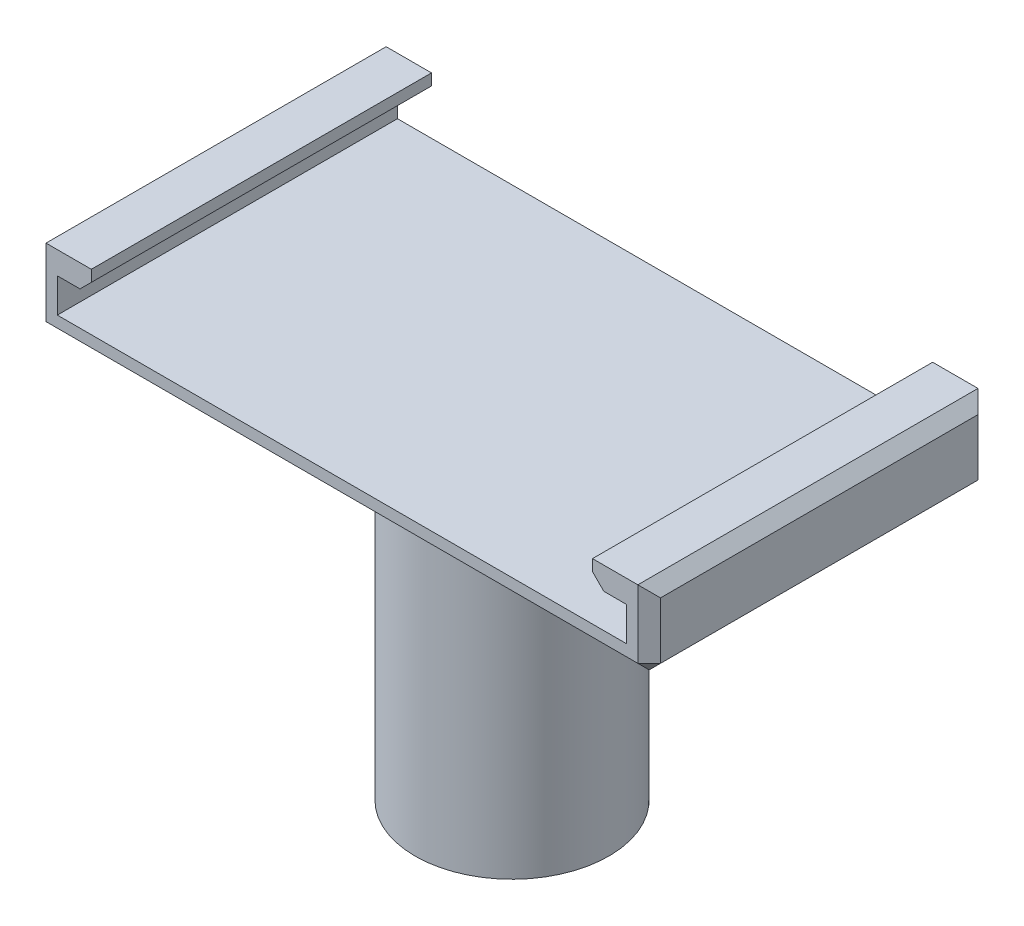
ISO-10303-21;
HEADER;
FILE_DESCRIPTION(('STEP AP214'),'2;1');
FILE_NAME('part.step','',(''),(''),'','','');
FILE_SCHEMA(('AUTOMOTIVE_DESIGN { 1 0 10303 214 1 1 1 1 }'));
ENDSEC;
DATA;
#1=APPLICATION_CONTEXT('core data for automotive mechanical design processes');
#2=APPLICATION_PROTOCOL_DEFINITION('international standard','automotive_design',2000,#1);
#3=PRODUCT_CONTEXT('',#1,'mechanical');
#4=PRODUCT('Part','Part','',(#3));
#5=PRODUCT_RELATED_PRODUCT_CATEGORY('part','',(#4));
#6=PRODUCT_DEFINITION_FORMATION('','',#4);
#7=PRODUCT_DEFINITION_CONTEXT('part definition',#1,'design');
#8=PRODUCT_DEFINITION('design','',#6,#7);
#9=PRODUCT_DEFINITION_SHAPE('','',#8);
#10=(LENGTH_UNIT() NAMED_UNIT(*) SI_UNIT(.MILLI.,.METRE.));
#11=(NAMED_UNIT(*) PLANE_ANGLE_UNIT() SI_UNIT($,.RADIAN.));
#12=(NAMED_UNIT(*) SI_UNIT($,.STERADIAN.) SOLID_ANGLE_UNIT());
#13=UNCERTAINTY_MEASURE_WITH_UNIT(LENGTH_MEASURE(1.E-05),#10,'distance_accuracy_value','');
#14=(GEOMETRIC_REPRESENTATION_CONTEXT(3) GLOBAL_UNCERTAINTY_ASSIGNED_CONTEXT((#13)) GLOBAL_UNIT_ASSIGNED_CONTEXT((#10,
#11,#12)) REPRESENTATION_CONTEXT('',''));
#15=CARTESIAN_POINT('',(0.,0.,0.));
#16=DIRECTION('',(0.,0.,1.));
#17=DIRECTION('',(1.,0.,0.));
#18=AXIS2_PLACEMENT_3D('',#15,#16,#17);
#19=CARTESIAN_POINT('',(25.1,37.,-15.));
#20=DIRECTION('',(1.,0.,0.));
#21=DIRECTION('',(0.,0.,-1.));
#22=AXIS2_PLACEMENT_3D('',#19,#20,#21);
#23=PLANE('',#22);
#24=DIRECTION('',(0.,0.,1.));
#25=VECTOR('',#24,1.);
#26=CARTESIAN_POINT('',(25.1,35.,-15.));
#27=LINE('',#26,#25);
#28=CARTESIAN_POINT('',(25.1,35.,-15.));
#29=VERTEX_POINT('',#28);
#30=CARTESIAN_POINT('',(25.1,35.,15.));
#31=VERTEX_POINT('',#30);
#32=EDGE_CURVE('E212',#29,#31,#27,.T.);
#33=ORIENTED_EDGE('',*,*,#32,.F.);
#34=DIRECTION('',(0.,-1.,0.));
#35=VECTOR('',#34,1.);
#36=CARTESIAN_POINT('',(25.1,37.,-15.));
#37=LINE('',#36,#35);
#38=CARTESIAN_POINT('',(25.1,32.,-15.));
#39=VERTEX_POINT('',#38);
#40=EDGE_CURVE('E247',#29,#39,#37,.T.);
#41=ORIENTED_EDGE('',*,*,#40,.T.);
#42=DIRECTION('',(0.,0.,1.));
#43=VECTOR('',#42,1.);
#44=CARTESIAN_POINT('',(25.1,32.,-15.));
#45=LINE('',#44,#43);
#46=CARTESIAN_POINT('',(25.1,32.,15.));
#47=VERTEX_POINT('',#46);
#48=EDGE_CURVE('E239',#39,#47,#45,.T.);
#49=ORIENTED_EDGE('',*,*,#48,.T.);
#50=DIRECTION('',(0.,-1.,0.));
#51=VECTOR('',#50,1.);
#52=CARTESIAN_POINT('',(25.1,37.,15.));
#53=LINE('',#52,#51);
#54=EDGE_CURVE('E199',#31,#47,#53,.T.);
#55=ORIENTED_EDGE('',*,*,#54,.F.);
#56=EDGE_LOOP('',(#33,#41,#49,#55));
#57=FACE_BOUND('',#56,.T.);
#58=ADVANCED_FACE('F39',(#57),#23,.F.);
#59=CARTESIAN_POINT('',(-25.1,37.,-15.));
#60=DIRECTION('',(-1.,0.,0.));
#61=DIRECTION('',(0.,0.,1.));
#62=AXIS2_PLACEMENT_3D('',#59,#60,#61);
#63=PLANE('',#62);
#64=DIRECTION('',(0.,0.,-1.));
#65=VECTOR('',#64,1.);
#66=CARTESIAN_POINT('',(-25.1,35.,15.));
#67=LINE('',#66,#65);
#68=CARTESIAN_POINT('',(-25.1,35.,15.));
#69=VERTEX_POINT('',#68);
#70=CARTESIAN_POINT('',(-25.1,35.,-15.));
#71=VERTEX_POINT('',#70);
#72=EDGE_CURVE('E218',#69,#71,#67,.T.);
#73=ORIENTED_EDGE('',*,*,#72,.F.);
#74=DIRECTION('',(0.,-1.,0.));
#75=VECTOR('',#74,1.);
#76=CARTESIAN_POINT('',(-25.1,37.,15.));
#77=LINE('',#76,#75);
#78=CARTESIAN_POINT('',(-25.1,32.,15.));
#79=VERTEX_POINT('',#78);
#80=EDGE_CURVE('E264',#69,#79,#77,.T.);
#81=ORIENTED_EDGE('',*,*,#80,.T.);
#82=DIRECTION('',(0.,0.,-1.));
#83=VECTOR('',#82,1.);
#84=CARTESIAN_POINT('',(-25.1,32.,-15.));
#85=LINE('',#84,#83);
#86=CARTESIAN_POINT('',(-25.1,32.,-15.));
#87=VERTEX_POINT('',#86);
#88=EDGE_CURVE('E250',#79,#87,#85,.T.);
#89=ORIENTED_EDGE('',*,*,#88,.T.);
#90=DIRECTION('',(0.,-1.,0.));
#91=VECTOR('',#90,1.);
#92=CARTESIAN_POINT('',(-25.1,37.,-15.));
#93=LINE('',#92,#91);
#94=EDGE_CURVE('E258',#71,#87,#93,.T.);
#95=ORIENTED_EDGE('',*,*,#94,.F.);
#96=EDGE_LOOP('',(#73,#81,#89,#95));
#97=FACE_BOUND('',#96,.T.);
#98=ADVANCED_FACE('F490',(#97),#63,.F.);
#99=CARTESIAN_POINT('',(0.,32.,0.));
#100=DIRECTION('',(0.,1.,0.));
#101=DIRECTION('',(0.,0.,1.));
#102=AXIS2_PLACEMENT_3D('',#99,#100,#101);
#103=PLANE('',#102);
#104=DIRECTION('',(1.,0.,0.));
#105=VECTOR('',#104,1.);
#106=CARTESIAN_POINT('',(-25.,32.,15.));
#107=LINE('',#106,#105);
#108=EDGE_CURVE('E271',#79,#47,#107,.T.);
#109=ORIENTED_EDGE('',*,*,#108,.T.);
#110=ORIENTED_EDGE('',*,*,#48,.F.);
#111=DIRECTION('',(-1.,0.,0.));
#112=VECTOR('',#111,1.);
#113=CARTESIAN_POINT('',(25.,32.,-15.));
#114=LINE('',#113,#112);
#115=EDGE_CURVE('E267',#39,#87,#114,.T.);
#116=ORIENTED_EDGE('',*,*,#115,.T.);
#117=ORIENTED_EDGE('',*,*,#88,.F.);
#118=EDGE_LOOP('',(#109,#110,#116,#117));
#119=FACE_BOUND('',#118,.T.);
#120=ADVANCED_FACE('F485',(#119),#103,.T.);
#121=CARTESIAN_POINT('',(0.,30.,0.));
#122=DIRECTION('',(0.,-1.,0.));
#123=DIRECTION('',(0.,0.,-1.));
#124=AXIS2_PLACEMENT_3D('',#121,#122,#123);
#125=CYLINDRICAL_SURFACE('',#124,7.55);
#126=CARTESIAN_POINT('',(0.,0.,0.));
#127=DIRECTION('',(0.,1.,0.));
#128=DIRECTION('',(0.,0.,1.));
#129=AXIS2_PLACEMENT_3D('',#126,#127,#128);
#130=CIRCLE('',#129,7.55);
#131=CARTESIAN_POINT('',(0.,0.,7.55));
#132=VERTEX_POINT('',#131);
#133=EDGE_CURVE('E276',#132,#132,#130,.T.);
#134=ORIENTED_EDGE('',*,*,#133,.F.);
#135=EDGE_LOOP('',(#134));
#136=FACE_BOUND('',#135,.T.);
#137=CARTESIAN_POINT('',(0.,28.,0.));
#138=DIRECTION('',(0.,1.,0.));
#139=DIRECTION('',(0.,0.,1.));
#140=AXIS2_PLACEMENT_3D('',#137,#138,#139);
#141=CIRCLE('',#140,7.55);
#142=CARTESIAN_POINT('',(0.,28.,7.55));
#143=VERTEX_POINT('',#142);
#144=EDGE_CURVE('E275',#143,#143,#141,.T.);
#145=ORIENTED_EDGE('',*,*,#144,.T.);
#146=EDGE_LOOP('',(#145));
#147=FACE_BOUND('',#146,.T.);
#148=ADVANCED_FACE('F550',(#136,#147),#125,.F.);
#149=CARTESIAN_POINT('',(0.,0.,0.));
#150=DIRECTION('',(0.,1.,0.));
#151=DIRECTION('',(0.,0.,1.));
#152=AXIS2_PLACEMENT_3D('',#149,#150,#151);
#153=PLANE('',#152);
#154=CARTESIAN_POINT('',(0.,0.,0.));
#155=DIRECTION('',(0.,1.,0.));
#156=DIRECTION('',(0.,0.,1.));
#157=AXIS2_PLACEMENT_3D('',#154,#155,#156);
#158=CIRCLE('',#157,8.55);
#159=CARTESIAN_POINT('',(0.,0.,8.55));
#160=VERTEX_POINT('',#159);
#161=EDGE_CURVE('E280',#160,#160,#158,.T.);
#162=ORIENTED_EDGE('',*,*,#161,.F.);
#163=EDGE_LOOP('',(#162));
#164=FACE_BOUND('',#163,.T.);
#165=ORIENTED_EDGE('',*,*,#133,.T.);
#166=EDGE_LOOP('',(#165));
#167=FACE_BOUND('',#166,.T.);
#168=ADVANCED_FACE('F568',(#164,#167),#153,.F.);
#169=CARTESIAN_POINT('',(0.,30.,0.));
#170=DIRECTION('',(0.,-1.,0.));
#171=DIRECTION('',(0.,0.,-1.));
#172=AXIS2_PLACEMENT_3D('',#169,#170,#171);
#173=CYLINDRICAL_SURFACE('',#172,8.55);
#174=CARTESIAN_POINT('',(0.,27.,0.));
#175=DIRECTION('',(0.,1.,0.));
#176=DIRECTION('',(0.,0.,1.));
#177=AXIS2_PLACEMENT_3D('',#174,#175,#176);
#178=CIRCLE('',#177,8.55);
#179=CARTESIAN_POINT('',(0.,27.,8.55));
#180=VERTEX_POINT('',#179);
#181=EDGE_CURVE('E291',#180,#180,#178,.F.);
#182=ORIENTED_EDGE('',*,*,#181,.T.);
#183=EDGE_LOOP('',(#182));
#184=FACE_BOUND('',#183,.T.);
#185=ORIENTED_EDGE('',*,*,#161,.T.);
#186=EDGE_LOOP('',(#185));
#187=FACE_BOUND('',#186,.T.);
#188=ADVANCED_FACE('F564',(#184,#187),#173,.T.);
#189=CARTESIAN_POINT('',(0.,28.,0.));
#190=DIRECTION('',(0.,1.,0.));
#191=DIRECTION('',(0.,0.,1.));
#192=AXIS2_PLACEMENT_3D('',#189,#190,#191);
#193=PLANE('',#192);
#194=ORIENTED_EDGE('',*,*,#144,.F.);
#195=EDGE_LOOP('',(#194));
#196=FACE_BOUND('',#195,.T.);
#197=ADVANCED_FACE('F561',(#196),#193,.F.);
#198=CARTESIAN_POINT('',(-25.,32.,-15.));
#199=DIRECTION('',(0.,0.,1.));
#200=DIRECTION('',(1.,0.,0.));
#201=AXIS2_PLACEMENT_3D('',#198,#199,#200);
#202=PLANE('',#201);
#203=DIRECTION('',(-1.,0.,0.));
#204=VECTOR('',#203,1.);
#205=CARTESIAN_POINT('',(-25.,31.,-15.));
#206=LINE('',#205,#204);
#207=CARTESIAN_POINT('',(26.1,31.,-15.));
#208=VERTEX_POINT('',#207);
#209=CARTESIAN_POINT('',(-26.1,31.,-15.));
#210=VERTEX_POINT('',#209);
#211=EDGE_CURVE('E332',#208,#210,#206,.T.);
#212=ORIENTED_EDGE('',*,*,#211,.T.);
#213=DIRECTION('',(0.,1.,0.));
#214=VECTOR('',#213,1.);
#215=CARTESIAN_POINT('',(-26.1,32.,-15.));
#216=LINE('',#215,#214);
#217=CARTESIAN_POINT('',(-26.1,37.,-15.));
#218=VERTEX_POINT('',#217);
#219=EDGE_CURVE('E338',#210,#218,#216,.T.);
#220=ORIENTED_EDGE('',*,*,#219,.T.);
#221=DIRECTION('',(-1.,0.,0.));
#222=VECTOR('',#221,1.);
#223=CARTESIAN_POINT('',(-27.1,37.,-15.));
#224=LINE('',#223,#222);
#225=CARTESIAN_POINT('',(-22.1,37.,-15.));
#226=VERTEX_POINT('',#225);
#227=EDGE_CURVE('E254',#226,#218,#224,.T.);
#228=ORIENTED_EDGE('',*,*,#227,.F.);
#229=DIRECTION('',(0.,1.,0.));
#230=VECTOR('',#229,1.);
#231=CARTESIAN_POINT('',(-22.1,37.,-15.));
#232=LINE('',#231,#230);
#233=CARTESIAN_POINT('',(-22.1,36.,-15.));
#234=VERTEX_POINT('',#233);
#235=EDGE_CURVE('E223',#234,#226,#232,.T.);
#236=ORIENTED_EDGE('',*,*,#235,.F.);
#237=DIRECTION('',(-0.707106781186553,-0.707106781186542,0.));
#238=VECTOR('',#237,1.);
#239=CARTESIAN_POINT('',(-22.1,36.,-15.));
#240=LINE('',#239,#238);
#241=CARTESIAN_POINT('',(-23.1,35.,-15.));
#242=VERTEX_POINT('',#241);
#243=EDGE_CURVE('E302',#234,#242,#240,.T.);
#244=ORIENTED_EDGE('',*,*,#243,.T.);
#245=DIRECTION('',(-1.,0.,0.));
#246=VECTOR('',#245,1.);
#247=CARTESIAN_POINT('',(-22.1,35.,-15.));
#248=LINE('',#247,#246);
#249=EDGE_CURVE('E230',#242,#71,#248,.T.);
#250=ORIENTED_EDGE('',*,*,#249,.T.);
#251=ORIENTED_EDGE('',*,*,#94,.T.);
#252=ORIENTED_EDGE('',*,*,#115,.F.);
#253=ORIENTED_EDGE('',*,*,#40,.F.);
#254=DIRECTION('',(1.,0.,0.));
#255=VECTOR('',#254,1.);
#256=CARTESIAN_POINT('',(22.1,35.,-15.));
#257=LINE('',#256,#255);
#258=CARTESIAN_POINT('',(23.1,35.,-15.));
#259=VERTEX_POINT('',#258);
#260=EDGE_CURVE('E208',#259,#29,#257,.T.);
#261=ORIENTED_EDGE('',*,*,#260,.F.);
#262=DIRECTION('',(-0.707106781186552,0.707106781186543,0.));
#263=VECTOR('',#262,1.);
#264=CARTESIAN_POINT('',(22.1,36.,-15.));
#265=LINE('',#264,#263);
#266=CARTESIAN_POINT('',(22.1,36.,-15.));
#267=VERTEX_POINT('',#266);
#268=EDGE_CURVE('E299',#259,#267,#265,.T.);
#269=ORIENTED_EDGE('',*,*,#268,.T.);
#270=DIRECTION('',(0.,-1.,0.));
#271=VECTOR('',#270,1.);
#272=CARTESIAN_POINT('',(22.1,37.,-15.));
#273=LINE('',#272,#271);
#274=CARTESIAN_POINT('',(22.1,37.,-15.));
#275=VERTEX_POINT('',#274);
#276=EDGE_CURVE('E189',#275,#267,#273,.T.);
#277=ORIENTED_EDGE('',*,*,#276,.F.);
#278=DIRECTION('',(-1.,0.,0.));
#279=VECTOR('',#278,1.);
#280=CARTESIAN_POINT('',(27.1,37.,-15.));
#281=LINE('',#280,#279);
#282=CARTESIAN_POINT('',(26.1,37.,-15.));
#283=VERTEX_POINT('',#282);
#284=EDGE_CURVE('E200',#283,#275,#281,.T.);
#285=ORIENTED_EDGE('',*,*,#284,.F.);
#286=DIRECTION('',(0.,-1.,0.));
#287=VECTOR('',#286,1.);
#288=CARTESIAN_POINT('',(26.1,32.,-15.));
#289=LINE('',#288,#287);
#290=EDGE_CURVE('E335',#283,#208,#289,.T.);
#291=ORIENTED_EDGE('',*,*,#290,.T.);
#292=EDGE_LOOP('',(#212,#220,#228,#236,#244,#250,#251,#252,#253,#261,#269,#277,#285,#291));
#293=FACE_BOUND('',#292,.T.);
#294=ADVANCED_FACE('F466',(#293),#202,.F.);
#295=CARTESIAN_POINT('',(-27.1,32.,15.));
#296=DIRECTION('',(1.,0.,0.));
#297=DIRECTION('',(0.,0.,-1.));
#298=AXIS2_PLACEMENT_3D('',#295,#296,#297);
#299=PLANE('',#298);
#300=DIRECTION('',(0.,0.,-1.));
#301=VECTOR('',#300,1.);
#302=CARTESIAN_POINT('',(-27.1,36.,-15.));
#303=LINE('',#302,#301);
#304=CARTESIAN_POINT('',(-27.1,36.,14.));
#305=VERTEX_POINT('',#304);
#306=CARTESIAN_POINT('',(-27.1,36.,-14.));
#307=VERTEX_POINT('',#306);
#308=EDGE_CURVE('E325',#305,#307,#303,.T.);
#309=ORIENTED_EDGE('',*,*,#308,.T.);
#310=DIRECTION('',(0.,-1.,0.));
#311=VECTOR('',#310,1.);
#312=CARTESIAN_POINT('',(-27.1,32.,-14.));
#313=LINE('',#312,#311);
#314=CARTESIAN_POINT('',(-27.1,31.,-14.));
#315=VERTEX_POINT('',#314);
#316=EDGE_CURVE('E328',#307,#315,#313,.T.);
#317=ORIENTED_EDGE('',*,*,#316,.T.);
#318=DIRECTION('',(0.,0.,1.));
#319=VECTOR('',#318,1.);
#320=CARTESIAN_POINT('',(-27.1,31.,15.));
#321=LINE('',#320,#319);
#322=CARTESIAN_POINT('',(-27.1,31.,14.));
#323=VERTEX_POINT('',#322);
#324=EDGE_CURVE('E319',#315,#323,#321,.T.);
#325=ORIENTED_EDGE('',*,*,#324,.T.);
#326=DIRECTION('',(0.,1.,0.));
#327=VECTOR('',#326,1.);
#328=CARTESIAN_POINT('',(-27.1,32.,14.));
#329=LINE('',#328,#327);
#330=EDGE_CURVE('E322',#323,#305,#329,.T.);
#331=ORIENTED_EDGE('',*,*,#330,.T.);
#332=EDGE_LOOP('',(#309,#317,#325,#331));
#333=FACE_BOUND('',#332,.T.);
#334=ADVANCED_FACE('F522',(#333),#299,.F.);
#335=CARTESIAN_POINT('',(25.,32.,15.));
#336=DIRECTION('',(0.,0.,-1.));
#337=DIRECTION('',(-1.,0.,0.));
#338=AXIS2_PLACEMENT_3D('',#335,#336,#337);
#339=PLANE('',#338);
#340=DIRECTION('',(1.,0.,0.));
#341=VECTOR('',#340,1.);
#342=CARTESIAN_POINT('',(25.,31.,15.));
#343=LINE('',#342,#341);
#344=CARTESIAN_POINT('',(-26.1,31.,15.));
#345=VERTEX_POINT('',#344);
#346=CARTESIAN_POINT('',(26.1,31.,15.));
#347=VERTEX_POINT('',#346);
#348=EDGE_CURVE('E358',#345,#347,#343,.T.);
#349=ORIENTED_EDGE('',*,*,#348,.T.);
#350=DIRECTION('',(0.,1.,0.));
#351=VECTOR('',#350,1.);
#352=CARTESIAN_POINT('',(26.1,32.,15.));
#353=LINE('',#352,#351);
#354=CARTESIAN_POINT('',(26.1,37.,15.));
#355=VERTEX_POINT('',#354);
#356=EDGE_CURVE('E195',#347,#355,#353,.T.);
#357=ORIENTED_EDGE('',*,*,#356,.T.);
#358=DIRECTION('',(1.,0.,0.));
#359=VECTOR('',#358,1.);
#360=CARTESIAN_POINT('',(27.1,37.,15.));
#361=LINE('',#360,#359);
#362=CARTESIAN_POINT('',(22.1,37.,15.));
#363=VERTEX_POINT('',#362);
#364=EDGE_CURVE('E192',#363,#355,#361,.T.);
#365=ORIENTED_EDGE('',*,*,#364,.F.);
#366=DIRECTION('',(0.,1.,0.));
#367=VECTOR('',#366,1.);
#368=CARTESIAN_POINT('',(22.1,37.,15.));
#369=LINE('',#368,#367);
#370=CARTESIAN_POINT('',(22.1,36.,15.));
#371=VERTEX_POINT('',#370);
#372=EDGE_CURVE('E178',#371,#363,#369,.T.);
#373=ORIENTED_EDGE('',*,*,#372,.F.);
#374=DIRECTION('',(0.707106781186552,-0.707106781186543,0.));
#375=VECTOR('',#374,1.);
#376=CARTESIAN_POINT('',(22.1,36.,15.));
#377=LINE('',#376,#375);
#378=CARTESIAN_POINT('',(23.1,35.,15.));
#379=VERTEX_POINT('',#378);
#380=EDGE_CURVE('E308',#371,#379,#377,.T.);
#381=ORIENTED_EDGE('',*,*,#380,.T.);
#382=DIRECTION('',(1.,0.,0.));
#383=VECTOR('',#382,1.);
#384=CARTESIAN_POINT('',(22.1,35.,15.));
#385=LINE('',#384,#383);
#386=EDGE_CURVE('E205',#379,#31,#385,.T.);
#387=ORIENTED_EDGE('',*,*,#386,.T.);
#388=ORIENTED_EDGE('',*,*,#54,.T.);
#389=ORIENTED_EDGE('',*,*,#108,.F.);
#390=ORIENTED_EDGE('',*,*,#80,.F.);
#391=DIRECTION('',(-1.,0.,0.));
#392=VECTOR('',#391,1.);
#393=CARTESIAN_POINT('',(-22.1,35.,15.));
#394=LINE('',#393,#392);
#395=CARTESIAN_POINT('',(-23.1,35.,15.));
#396=VERTEX_POINT('',#395);
#397=EDGE_CURVE('E236',#396,#69,#394,.T.);
#398=ORIENTED_EDGE('',*,*,#397,.F.);
#399=DIRECTION('',(0.707106781186553,0.707106781186542,0.));
#400=VECTOR('',#399,1.);
#401=CARTESIAN_POINT('',(-22.1,36.,15.));
#402=LINE('',#401,#400);
#403=CARTESIAN_POINT('',(-22.1,36.,15.));
#404=VERTEX_POINT('',#403);
#405=EDGE_CURVE('E311',#396,#404,#402,.T.);
#406=ORIENTED_EDGE('',*,*,#405,.T.);
#407=DIRECTION('',(0.,-1.,0.));
#408=VECTOR('',#407,1.);
#409=CARTESIAN_POINT('',(-22.1,37.,15.));
#410=LINE('',#409,#408);
#411=CARTESIAN_POINT('',(-22.1,37.,15.));
#412=VERTEX_POINT('',#411);
#413=EDGE_CURVE('E219',#412,#404,#410,.T.);
#414=ORIENTED_EDGE('',*,*,#413,.F.);
#415=DIRECTION('',(1.,0.,0.));
#416=VECTOR('',#415,1.);
#417=CARTESIAN_POINT('',(-27.1,37.,15.));
#418=LINE('',#417,#416);
#419=CARTESIAN_POINT('',(-26.1,37.,15.));
#420=VERTEX_POINT('',#419);
#421=EDGE_CURVE('E251',#420,#412,#418,.T.);
#422=ORIENTED_EDGE('',*,*,#421,.F.);
#423=DIRECTION('',(0.,-1.,0.));
#424=VECTOR('',#423,1.);
#425=CARTESIAN_POINT('',(-26.1,32.,15.));
#426=LINE('',#425,#424);
#427=EDGE_CURVE('E361',#420,#345,#426,.T.);
#428=ORIENTED_EDGE('',*,*,#427,.T.);
#429=EDGE_LOOP('',(#349,#357,#365,#373,#381,#387,#388,#389,#390,#398,#406,#414,#422,#428));
#430=FACE_BOUND('',#429,.T.);
#431=ADVANCED_FACE('F193',(#430),#339,.F.);
#432=CARTESIAN_POINT('',(27.1,32.,15.));
#433=DIRECTION('',(-1.,0.,0.));
#434=DIRECTION('',(0.,0.,1.));
#435=AXIS2_PLACEMENT_3D('',#432,#433,#434);
#436=PLANE('',#435);
#437=DIRECTION('',(0.,0.,-1.));
#438=VECTOR('',#437,1.);
#439=CARTESIAN_POINT('',(27.1,31.,15.));
#440=LINE('',#439,#438);
#441=CARTESIAN_POINT('',(27.1,31.,14.));
#442=VERTEX_POINT('',#441);
#443=CARTESIAN_POINT('',(27.1,31.,-14.));
#444=VERTEX_POINT('',#443);
#445=EDGE_CURVE('E342',#442,#444,#440,.T.);
#446=ORIENTED_EDGE('',*,*,#445,.T.);
#447=DIRECTION('',(0.,1.,0.));
#448=VECTOR('',#447,1.);
#449=CARTESIAN_POINT('',(27.1,32.,-14.));
#450=LINE('',#449,#448);
#451=CARTESIAN_POINT('',(27.1,36.,-14.));
#452=VERTEX_POINT('',#451);
#453=EDGE_CURVE('E351',#444,#452,#450,.T.);
#454=ORIENTED_EDGE('',*,*,#453,.T.);
#455=DIRECTION('',(0.,0.,1.));
#456=VECTOR('',#455,1.);
#457=CARTESIAN_POINT('',(27.1,36.,15.));
#458=LINE('',#457,#456);
#459=CARTESIAN_POINT('',(27.1,36.,14.));
#460=VERTEX_POINT('',#459);
#461=EDGE_CURVE('E348',#452,#460,#458,.T.);
#462=ORIENTED_EDGE('',*,*,#461,.T.);
#463=DIRECTION('',(0.,-1.,0.));
#464=VECTOR('',#463,1.);
#465=CARTESIAN_POINT('',(27.1,32.,14.));
#466=LINE('',#465,#464);
#467=EDGE_CURVE('E345',#460,#442,#466,.T.);
#468=ORIENTED_EDGE('',*,*,#467,.T.);
#469=EDGE_LOOP('',(#446,#454,#462,#468));
#470=FACE_BOUND('',#469,.T.);
#471=ADVANCED_FACE('F457',(#470),#436,.F.);
#472=CARTESIAN_POINT('',(0.,30.,0.));
#473=DIRECTION('',(0.,1.,0.));
#474=DIRECTION('',(0.,0.,1.));
#475=AXIS2_PLACEMENT_3D('',#472,#473,#474);
#476=PLANE('',#475);
#477=DIRECTION('',(0.,0.,1.));
#478=VECTOR('',#477,1.);
#479=CARTESIAN_POINT('',(26.1,30.,0.));
#480=LINE('',#479,#478);
#481=CARTESIAN_POINT('',(26.1,30.,-14.));
#482=VERTEX_POINT('',#481);
#483=CARTESIAN_POINT('',(26.1,30.,14.));
#484=VERTEX_POINT('',#483);
#485=EDGE_CURVE('E369',#482,#484,#480,.T.);
#486=ORIENTED_EDGE('',*,*,#485,.T.);
#487=DIRECTION('',(-1.,0.,0.));
#488=VECTOR('',#487,1.);
#489=CARTESIAN_POINT('',(0.,30.,14.));
#490=LINE('',#489,#488);
#491=CARTESIAN_POINT('',(-26.1,30.,14.));
#492=VERTEX_POINT('',#491);
#493=EDGE_CURVE('E11',#484,#492,#490,.T.);
#494=ORIENTED_EDGE('',*,*,#493,.T.);
#495=DIRECTION('',(0.,0.,-1.));
#496=VECTOR('',#495,1.);
#497=CARTESIAN_POINT('',(-26.1,30.,0.));
#498=LINE('',#497,#496);
#499=CARTESIAN_POINT('',(-26.1,30.,-14.));
#500=VERTEX_POINT('',#499);
#501=EDGE_CURVE('E49',#492,#500,#498,.T.);
#502=ORIENTED_EDGE('',*,*,#501,.T.);
#503=DIRECTION('',(1.,0.,0.));
#504=VECTOR('',#503,1.);
#505=CARTESIAN_POINT('',(0.,30.,-14.));
#506=LINE('',#505,#504);
#507=EDGE_CURVE('E372',#500,#482,#506,.T.);
#508=ORIENTED_EDGE('',*,*,#507,.T.);
#509=EDGE_LOOP('',(#486,#494,#502,#508));
#510=FACE_BOUND('',#509,.T.);
#511=CARTESIAN_POINT('',(0.,30.,0.));
#512=DIRECTION('',(0.,1.,0.));
#513=DIRECTION('',(0.,0.,1.));
#514=AXIS2_PLACEMENT_3D('',#511,#512,#513);
#515=CIRCLE('',#514,11.55);
#516=CARTESIAN_POINT('',(0.,30.,11.55));
#517=VERTEX_POINT('',#516);
#518=EDGE_CURVE('E284',#517,#517,#515,.T.);
#519=ORIENTED_EDGE('',*,*,#518,.T.);
#520=EDGE_LOOP('',(#519));
#521=FACE_BOUND('',#520,.T.);
#522=ADVANCED_FACE('F449',(#510,#521),#476,.F.);
#523=CARTESIAN_POINT('',(0.,37.,0.));
#524=DIRECTION('',(0.,1.,0.));
#525=DIRECTION('',(0.,0.,1.));
#526=AXIS2_PLACEMENT_3D('',#523,#524,#525);
#527=PLANE('',#526);
#528=ORIENTED_EDGE('',*,*,#227,.T.);
#529=DIRECTION('',(0.,0.,1.));
#530=VECTOR('',#529,1.);
#531=CARTESIAN_POINT('',(-26.1,37.,15.));
#532=LINE('',#531,#530);
#533=EDGE_CURVE('E366',#218,#420,#532,.T.);
#534=ORIENTED_EDGE('',*,*,#533,.T.);
#535=ORIENTED_EDGE('',*,*,#421,.T.);
#536=DIRECTION('',(0.,0.,1.));
#537=VECTOR('',#536,1.);
#538=CARTESIAN_POINT('',(-22.1,37.,15.));
#539=LINE('',#538,#537);
#540=EDGE_CURVE('E226',#226,#412,#539,.T.);
#541=ORIENTED_EDGE('',*,*,#540,.F.);
#542=EDGE_LOOP('',(#528,#534,#535,#541));
#543=FACE_BOUND('',#542,.T.);
#544=ADVANCED_FACE('F507',(#543),#527,.T.);
#545=CARTESIAN_POINT('',(0.,37.,0.));
#546=DIRECTION('',(0.,-1.,0.));
#547=DIRECTION('',(0.,0.,-1.));
#548=AXIS2_PLACEMENT_3D('',#545,#546,#547);
#549=PLANE('',#548);
#550=ORIENTED_EDGE('',*,*,#364,.T.);
#551=DIRECTION('',(0.,0.,-1.));
#552=VECTOR('',#551,1.);
#553=CARTESIAN_POINT('',(26.1,37.,0.));
#554=LINE('',#553,#552);
#555=EDGE_CURVE('E355',#355,#283,#554,.T.);
#556=ORIENTED_EDGE('',*,*,#555,.T.);
#557=ORIENTED_EDGE('',*,*,#284,.T.);
#558=DIRECTION('',(0.,0.,-1.));
#559=VECTOR('',#558,1.);
#560=CARTESIAN_POINT('',(22.1,37.,-15.));
#561=LINE('',#560,#559);
#562=EDGE_CURVE('E183',#363,#275,#561,.T.);
#563=ORIENTED_EDGE('',*,*,#562,.F.);
#564=EDGE_LOOP('',(#550,#556,#557,#563));
#565=FACE_BOUND('',#564,.T.);
#566=ADVANCED_FACE('F202',(#565),#549,.F.);
#567=CARTESIAN_POINT('',(-22.1,35.,15.));
#568=DIRECTION('',(0.,1.,0.));
#569=DIRECTION('',(0.,0.,1.));
#570=AXIS2_PLACEMENT_3D('',#567,#568,#569);
#571=PLANE('',#570);
#572=ORIENTED_EDGE('',*,*,#249,.F.);
#573=DIRECTION('',(0.,0.,1.));
#574=VECTOR('',#573,1.);
#575=CARTESIAN_POINT('',(-23.1,35.,15.));
#576=LINE('',#575,#574);
#577=EDGE_CURVE('E305',#242,#396,#576,.T.);
#578=ORIENTED_EDGE('',*,*,#577,.T.);
#579=ORIENTED_EDGE('',*,*,#397,.T.);
#580=ORIENTED_EDGE('',*,*,#72,.T.);
#581=EDGE_LOOP('',(#572,#578,#579,#580));
#582=FACE_BOUND('',#581,.T.);
#583=ADVANCED_FACE('F725',(#582),#571,.F.);
#584=CARTESIAN_POINT('',(-22.1,0.,0.));
#585=DIRECTION('',(1.,0.,0.));
#586=DIRECTION('',(0.,0.,-1.));
#587=AXIS2_PLACEMENT_3D('',#584,#585,#586);
#588=PLANE('',#587);
#589=ORIENTED_EDGE('',*,*,#413,.T.);
#590=DIRECTION('',(0.,0.,-1.));
#591=VECTOR('',#590,1.);
#592=CARTESIAN_POINT('',(-22.1,36.,-15.));
#593=LINE('',#592,#591);
#594=EDGE_CURVE('E295',#404,#234,#593,.T.);
#595=ORIENTED_EDGE('',*,*,#594,.T.);
#596=ORIENTED_EDGE('',*,*,#235,.T.);
#597=ORIENTED_EDGE('',*,*,#540,.T.);
#598=EDGE_LOOP('',(#589,#595,#596,#597));
#599=FACE_BOUND('',#598,.T.);
#600=ADVANCED_FACE('F501',(#599),#588,.T.);
#601=CARTESIAN_POINT('',(22.1,35.,-15.));
#602=DIRECTION('',(0.,1.,0.));
#603=DIRECTION('',(0.,0.,1.));
#604=AXIS2_PLACEMENT_3D('',#601,#602,#603);
#605=PLANE('',#604);
#606=ORIENTED_EDGE('',*,*,#386,.F.);
#607=DIRECTION('',(0.,0.,-1.));
#608=VECTOR('',#607,1.);
#609=CARTESIAN_POINT('',(23.1,35.,-15.));
#610=LINE('',#609,#608);
#611=EDGE_CURVE('E316',#379,#259,#610,.T.);
#612=ORIENTED_EDGE('',*,*,#611,.T.);
#613=ORIENTED_EDGE('',*,*,#260,.T.);
#614=ORIENTED_EDGE('',*,*,#32,.T.);
#615=EDGE_LOOP('',(#606,#612,#613,#614));
#616=FACE_BOUND('',#615,.T.);
#617=ADVANCED_FACE('F475',(#616),#605,.F.);
#618=CARTESIAN_POINT('',(22.1,0.,0.));
#619=DIRECTION('',(-1.,0.,0.));
#620=DIRECTION('',(0.,0.,1.));
#621=AXIS2_PLACEMENT_3D('',#618,#619,#620);
#622=PLANE('',#621);
#623=ORIENTED_EDGE('',*,*,#276,.T.);
#624=DIRECTION('',(0.,0.,1.));
#625=VECTOR('',#624,1.);
#626=CARTESIAN_POINT('',(22.1,36.,15.));
#627=LINE('',#626,#625);
#628=EDGE_CURVE('E186',#267,#371,#627,.T.);
#629=ORIENTED_EDGE('',*,*,#628,.T.);
#630=ORIENTED_EDGE('',*,*,#372,.T.);
#631=ORIENTED_EDGE('',*,*,#562,.T.);
#632=EDGE_LOOP('',(#623,#629,#630,#631));
#633=FACE_BOUND('',#632,.T.);
#634=ADVANCED_FACE('F181',(#633),#622,.T.);
#635=CARTESIAN_POINT('',(0.,30.,0.));
#636=DIRECTION('',(0.,1.,0.));
#637=DIRECTION('',(0.,0.,1.));
#638=AXIS2_PLACEMENT_3D('',#635,#636,#637);
#639=CONICAL_SURFACE('',#638,11.55,0.785398163397453);
#640=ORIENTED_EDGE('',*,*,#181,.F.);
#641=EDGE_LOOP('',(#640));
#642=FACE_BOUND('',#641,.T.);
#643=ORIENTED_EDGE('',*,*,#518,.F.);
#644=EDGE_LOOP('',(#643));
#645=FACE_BOUND('',#644,.T.);
#646=ADVANCED_FACE('F576',(#642,#645),#639,.T.);
#647=CARTESIAN_POINT('',(-22.1,36.,0.));
#648=DIRECTION('',(0.707106781186542,-0.707106781186553,0.));
#649=DIRECTION('',(0.,0.,1.));
#650=AXIS2_PLACEMENT_3D('',#647,#648,#649);
#651=PLANE('',#650);
#652=ORIENTED_EDGE('',*,*,#405,.F.);
#653=ORIENTED_EDGE('',*,*,#577,.F.);
#654=ORIENTED_EDGE('',*,*,#243,.F.);
#655=ORIENTED_EDGE('',*,*,#594,.F.);
#656=EDGE_LOOP('',(#652,#653,#654,#655));
#657=FACE_BOUND('',#656,.T.);
#658=ADVANCED_FACE('F498',(#657),#651,.T.);
#659=CARTESIAN_POINT('',(22.1,36.,0.));
#660=DIRECTION('',(-0.707106781186543,-0.707106781186552,0.));
#661=DIRECTION('',(0.,0.,-1.));
#662=AXIS2_PLACEMENT_3D('',#659,#660,#661);
#663=PLANE('',#662);
#664=ORIENTED_EDGE('',*,*,#268,.F.);
#665=ORIENTED_EDGE('',*,*,#611,.F.);
#666=ORIENTED_EDGE('',*,*,#380,.F.);
#667=ORIENTED_EDGE('',*,*,#628,.F.);
#668=EDGE_LOOP('',(#664,#665,#666,#667));
#669=FACE_BOUND('',#668,.T.);
#670=ADVANCED_FACE('F471',(#669),#663,.T.);
#671=CARTESIAN_POINT('',(27.1,32.,14.));
#672=DIRECTION('',(-0.707106781186545,0.,-0.70710678118655));
#673=DIRECTION('',(0.,-1.,0.));
#674=AXIS2_PLACEMENT_3D('',#671,#672,#673);
#675=PLANE('',#674);
#676=DIRECTION('',(0.70710678118655,0.,-0.707106781186545));
#677=VECTOR('',#676,1.);
#678=CARTESIAN_POINT('',(27.1,31.,14.));
#679=LINE('',#678,#677);
#680=EDGE_CURVE('E43',#442,#347,#679,.F.);
#681=ORIENTED_EDGE('',*,*,#680,.F.);
#682=ORIENTED_EDGE('',*,*,#467,.F.);
#683=DIRECTION('',(-0.577350269189628,0.577350269189625,0.577350269189624));
#684=VECTOR('',#683,1.);
#685=CARTESIAN_POINT('',(28.4333333333333,34.6666666666667,12.6666666666667));
#686=LINE('',#685,#684);
#687=EDGE_CURVE('E428',#355,#460,#686,.F.);
#688=ORIENTED_EDGE('',*,*,#687,.F.);
#689=ORIENTED_EDGE('',*,*,#356,.F.);
#690=EDGE_LOOP('',(#681,#682,#688,#689));
#691=FACE_BOUND('',#690,.T.);
#692=ADVANCED_FACE('F41',(#691),#675,.F.);
#693=CARTESIAN_POINT('',(27.1,31.,14.));
#694=DIRECTION('',(0.577350269189622,-0.577350269189628,0.577350269189627));
#695=DIRECTION('',(0.,-0.707106781186546,-0.707106781186549));
#696=AXIS2_PLACEMENT_3D('',#693,#694,#695);
#697=PLANE('',#696);
#698=DIRECTION('',(-0.707106781186549,-0.707106781186546,0.));
#699=VECTOR('',#698,1.);
#700=CARTESIAN_POINT('',(27.1,31.,14.));
#701=LINE('',#700,#699);
#702=EDGE_CURVE('E421',#442,#484,#701,.T.);
#703=ORIENTED_EDGE('',*,*,#702,.F.);
#704=ORIENTED_EDGE('',*,*,#680,.T.);
#705=DIRECTION('',(0.,0.707106781186545,0.70710678118655));
#706=VECTOR('',#705,1.);
#707=CARTESIAN_POINT('',(26.1,30.5,14.5));
#708=LINE('',#707,#706);
#709=EDGE_CURVE('E425',#484,#347,#708,.T.);
#710=ORIENTED_EDGE('',*,*,#709,.F.);
#711=EDGE_LOOP('',(#703,#704,#710));
#712=FACE_BOUND('',#711,.T.);
#713=ADVANCED_FACE('F440',(#712),#697,.T.);
#714=CARTESIAN_POINT('',(26.1,37.,0.));
#715=DIRECTION('',(-0.707106781186546,-0.707106781186549,0.));
#716=DIRECTION('',(0.,0.,-1.));
#717=AXIS2_PLACEMENT_3D('',#714,#715,#716);
#718=PLANE('',#717);
#719=ORIENTED_EDGE('',*,*,#687,.T.);
#720=ORIENTED_EDGE('',*,*,#461,.F.);
#721=DIRECTION('',(-0.577350269189627,0.577350269189624,-0.577350269189627));
#722=VECTOR('',#721,1.);
#723=CARTESIAN_POINT('',(31.1,32.,-9.99999999999996));
#724=LINE('',#723,#722);
#725=EDGE_CURVE('E418',#283,#452,#724,.F.);
#726=ORIENTED_EDGE('',*,*,#725,.F.);
#727=ORIENTED_EDGE('',*,*,#555,.F.);
#728=EDGE_LOOP('',(#719,#720,#726,#727));
#729=FACE_BOUND('',#728,.T.);
#730=ADVANCED_FACE('F464',(#729),#718,.F.);
#731=CARTESIAN_POINT('',(25.,31.,15.));
#732=DIRECTION('',(0.,0.70710678118655,-0.707106781186545));
#733=DIRECTION('',(1.,0.,0.));
#734=AXIS2_PLACEMENT_3D('',#731,#732,#733);
#735=PLANE('',#734);
#736=ORIENTED_EDGE('',*,*,#709,.T.);
#737=ORIENTED_EDGE('',*,*,#348,.F.);
#738=DIRECTION('',(0.,-0.707106781186545,-0.70710678118655));
#739=VECTOR('',#738,1.);
#740=CARTESIAN_POINT('',(-26.1,31.,15.));
#741=LINE('',#740,#739);
#742=EDGE_CURVE('E414',#492,#345,#741,.F.);
#743=ORIENTED_EDGE('',*,*,#742,.F.);
#744=ORIENTED_EDGE('',*,*,#493,.F.);
#745=EDGE_LOOP('',(#736,#737,#743,#744));
#746=FACE_BOUND('',#745,.T.);
#747=ADVANCED_FACE('F447',(#746),#735,.F.);
#748=CARTESIAN_POINT('',(27.1,31.,15.));
#749=DIRECTION('',(-0.707106781186546,0.707106781186549,0.));
#750=DIRECTION('',(0.,0.,-1.));
#751=AXIS2_PLACEMENT_3D('',#748,#749,#750);
#752=PLANE('',#751);
#753=ORIENTED_EDGE('',*,*,#702,.T.);
#754=ORIENTED_EDGE('',*,*,#485,.F.);
#755=DIRECTION('',(0.707106781186549,0.707106781186546,0.));
#756=VECTOR('',#755,1.);
#757=CARTESIAN_POINT('',(26.6,30.5,-14.));
#758=LINE('',#757,#756);
#759=EDGE_CURVE('E410',#444,#482,#758,.F.);
#760=ORIENTED_EDGE('',*,*,#759,.F.);
#761=ORIENTED_EDGE('',*,*,#445,.F.);
#762=EDGE_LOOP('',(#753,#754,#760,#761));
#763=FACE_BOUND('',#762,.T.);
#764=ADVANCED_FACE('F454',(#763),#752,.F.);
#765=CARTESIAN_POINT('',(26.1,32.,-15.));
#766=DIRECTION('',(-0.707106781186547,0.,0.707106781186547));
#767=DIRECTION('',(0.,-1.,0.));
#768=AXIS2_PLACEMENT_3D('',#765,#766,#767);
#769=PLANE('',#768);
#770=ORIENTED_EDGE('',*,*,#725,.T.);
#771=ORIENTED_EDGE('',*,*,#453,.F.);
#772=DIRECTION('',(-0.707106781186548,0.,-0.707106781186548));
#773=VECTOR('',#772,1.);
#774=CARTESIAN_POINT('',(26.1,31.,-15.));
#775=LINE('',#774,#773);
#776=EDGE_CURVE('E406',#208,#444,#775,.F.);
#777=ORIENTED_EDGE('',*,*,#776,.F.);
#778=ORIENTED_EDGE('',*,*,#290,.F.);
#779=EDGE_LOOP('',(#770,#771,#777,#778));
#780=FACE_BOUND('',#779,.T.);
#781=ADVANCED_FACE('F460',(#780),#769,.F.);
#782=CARTESIAN_POINT('',(-26.1,31.,15.));
#783=DIRECTION('',(-0.577350269189625,-0.577350269189629,0.577350269189623));
#784=DIRECTION('',(0.70710678118655,-0.707106781186545,0.));
#785=AXIS2_PLACEMENT_3D('',#782,#783,#784);
#786=PLANE('',#785);
#787=DIRECTION('',(-0.70710678118655,0.707106781186545,0.));
#788=VECTOR('',#787,1.);
#789=CARTESIAN_POINT('',(-26.6,30.5,14.));
#790=LINE('',#789,#788);
#791=EDGE_CURVE('E399',#492,#323,#790,.T.);
#792=ORIENTED_EDGE('',*,*,#791,.F.);
#793=ORIENTED_EDGE('',*,*,#742,.T.);
#794=DIRECTION('',(0.707106781186546,0.,0.707106781186549));
#795=VECTOR('',#794,1.);
#796=CARTESIAN_POINT('',(-26.1,31.,15.));
#797=LINE('',#796,#795);
#798=EDGE_CURVE('E402',#323,#345,#797,.T.);
#799=ORIENTED_EDGE('',*,*,#798,.F.);
#800=EDGE_LOOP('',(#792,#793,#799));
#801=FACE_BOUND('',#800,.T.);
#802=ADVANCED_FACE('F526',(#801),#786,.T.);
#803=CARTESIAN_POINT('',(26.1,31.,-15.));
#804=DIRECTION('',(0.577350269189623,-0.57735026918963,-0.577350269189623));
#805=DIRECTION('',(0.,0.707106781186543,-0.707106781186552));
#806=AXIS2_PLACEMENT_3D('',#803,#804,#805);
#807=PLANE('',#806);
#808=ORIENTED_EDGE('',*,*,#776,.T.);
#809=ORIENTED_EDGE('',*,*,#759,.T.);
#810=DIRECTION('',(0.,-0.707106781186545,0.70710678118655));
#811=VECTOR('',#810,1.);
#812=CARTESIAN_POINT('',(26.1,31.,-15.));
#813=LINE('',#812,#811);
#814=EDGE_CURVE('E395',#208,#482,#813,.T.);
#815=ORIENTED_EDGE('',*,*,#814,.F.);
#816=EDGE_LOOP('',(#808,#809,#815));
#817=FACE_BOUND('',#816,.T.);
#818=ADVANCED_FACE('F528',(#817),#807,.T.);
#819=CARTESIAN_POINT('',(-26.1,32.,15.));
#820=DIRECTION('',(0.707106781186549,0.,-0.707106781186546));
#821=DIRECTION('',(0.,-1.,0.));
#822=AXIS2_PLACEMENT_3D('',#819,#820,#821);
#823=PLANE('',#822);
#824=ORIENTED_EDGE('',*,*,#798,.T.);
#825=ORIENTED_EDGE('',*,*,#427,.F.);
#826=DIRECTION('',(0.577350269189624,0.577350269189628,0.577350269189626));
#827=VECTOR('',#826,1.);
#828=CARTESIAN_POINT('',(-27.7666666666667,35.3333333333333,13.3333333333333));
#829=LINE('',#828,#827);
#830=EDGE_CURVE('E391',#305,#420,#829,.T.);
#831=ORIENTED_EDGE('',*,*,#830,.F.);
#832=ORIENTED_EDGE('',*,*,#330,.F.);
#833=EDGE_LOOP('',(#824,#825,#831,#832));
#834=FACE_BOUND('',#833,.T.);
#835=ADVANCED_FACE('F512',(#834),#823,.F.);
#836=CARTESIAN_POINT('',(-27.1,31.,15.));
#837=DIRECTION('',(0.707106781186545,0.70710678118655,0.));
#838=DIRECTION('',(0.,0.,1.));
#839=AXIS2_PLACEMENT_3D('',#836,#837,#838);
#840=PLANE('',#839);
#841=ORIENTED_EDGE('',*,*,#791,.T.);
#842=ORIENTED_EDGE('',*,*,#324,.F.);
#843=DIRECTION('',(0.70710678118655,-0.707106781186545,0.));
#844=VECTOR('',#843,1.);
#845=CARTESIAN_POINT('',(-27.1,31.,-14.));
#846=LINE('',#845,#844);
#847=EDGE_CURVE('E387',#500,#315,#846,.F.);
#848=ORIENTED_EDGE('',*,*,#847,.F.);
#849=ORIENTED_EDGE('',*,*,#501,.F.);
#850=EDGE_LOOP('',(#841,#842,#848,#849));
#851=FACE_BOUND('',#850,.T.);
#852=ADVANCED_FACE('F524',(#851),#840,.F.);
#853=CARTESIAN_POINT('',(-25.,31.,-15.));
#854=DIRECTION('',(0.,0.70710678118655,0.707106781186545));
#855=DIRECTION('',(-1.,0.,0.));
#856=AXIS2_PLACEMENT_3D('',#853,#854,#855);
#857=PLANE('',#856);
#858=ORIENTED_EDGE('',*,*,#814,.T.);
#859=ORIENTED_EDGE('',*,*,#507,.F.);
#860=DIRECTION('',(0.,0.707106781186545,-0.70710678118655));
#861=VECTOR('',#860,1.);
#862=CARTESIAN_POINT('',(-26.1,30.5,-14.5));
#863=LINE('',#862,#861);
#864=EDGE_CURVE('E383',#210,#500,#863,.F.);
#865=ORIENTED_EDGE('',*,*,#864,.F.);
#866=ORIENTED_EDGE('',*,*,#211,.F.);
#867=EDGE_LOOP('',(#858,#859,#865,#866));
#868=FACE_BOUND('',#867,.T.);
#869=ADVANCED_FACE('F594',(#868),#857,.F.);
#870=CARTESIAN_POINT('',(-26.1,37.,0.));
#871=DIRECTION('',(-0.70710678118655,0.707106781186545,0.));
#872=DIRECTION('',(0.,0.,-1.));
#873=AXIS2_PLACEMENT_3D('',#870,#871,#872);
#874=PLANE('',#873);
#875=ORIENTED_EDGE('',*,*,#830,.T.);
#876=ORIENTED_EDGE('',*,*,#533,.F.);
#877=DIRECTION('',(0.577350269189626,0.577350269189629,-0.577350269189622));
#878=VECTOR('',#877,1.);
#879=CARTESIAN_POINT('',(-31.1,32.,-10.0000000000001));
#880=LINE('',#879,#878);
#881=EDGE_CURVE('E380',#307,#218,#880,.T.);
#882=ORIENTED_EDGE('',*,*,#881,.F.);
#883=ORIENTED_EDGE('',*,*,#308,.F.);
#884=EDGE_LOOP('',(#875,#876,#882,#883));
#885=FACE_BOUND('',#884,.T.);
#886=ADVANCED_FACE('F518',(#885),#874,.T.);
#887=CARTESIAN_POINT('',(-27.1,31.,-14.));
#888=DIRECTION('',(-0.577350269189622,-0.57735026918963,-0.577350269189625));
#889=DIRECTION('',(0.,0.707106781186544,-0.707106781186551));
#890=AXIS2_PLACEMENT_3D('',#887,#888,#889);
#891=PLANE('',#890);
#892=ORIENTED_EDGE('',*,*,#864,.T.);
#893=ORIENTED_EDGE('',*,*,#847,.T.);
#894=DIRECTION('',(-0.707106781186549,0.,0.707106781186546));
#895=VECTOR('',#894,1.);
#896=CARTESIAN_POINT('',(-27.1,31.,-14.));
#897=LINE('',#896,#895);
#898=EDGE_CURVE('E377',#210,#315,#897,.T.);
#899=ORIENTED_EDGE('',*,*,#898,.F.);
#900=EDGE_LOOP('',(#892,#893,#899));
#901=FACE_BOUND('',#900,.T.);
#902=ADVANCED_FACE('F587',(#901),#891,.T.);
#903=CARTESIAN_POINT('',(-27.1,32.,-14.));
#904=DIRECTION('',(0.707106781186546,0.,0.707106781186549));
#905=DIRECTION('',(0.,-1.,0.));
#906=AXIS2_PLACEMENT_3D('',#903,#904,#905);
#907=PLANE('',#906);
#908=ORIENTED_EDGE('',*,*,#881,.T.);
#909=ORIENTED_EDGE('',*,*,#219,.F.);
#910=ORIENTED_EDGE('',*,*,#898,.T.);
#911=ORIENTED_EDGE('',*,*,#316,.F.);
#912=EDGE_LOOP('',(#908,#909,#910,#911));
#913=FACE_BOUND('',#912,.T.);
#914=ADVANCED_FACE('F584',(#913),#907,.F.);
#915=CLOSED_SHELL('',(#58,#98,#120,#148,#168,#188,#197,#294,#334,#431,#471,#522,#544,#566,#583,
#600,#617,#634,#646,#658,#670,#692,#713,#730,#747,#764,#781,#802,#818,#835,#852,#869,#886,#902,#914));
#916=MANIFOLD_SOLID_BREP('B2',#915);
#917=ADVANCED_BREP_SHAPE_REPRESENTATION('',(#18,#916),#14);
#918=SHAPE_DEFINITION_REPRESENTATION(#9,#917);
ENDSEC;
END-ISO-10303-21;
